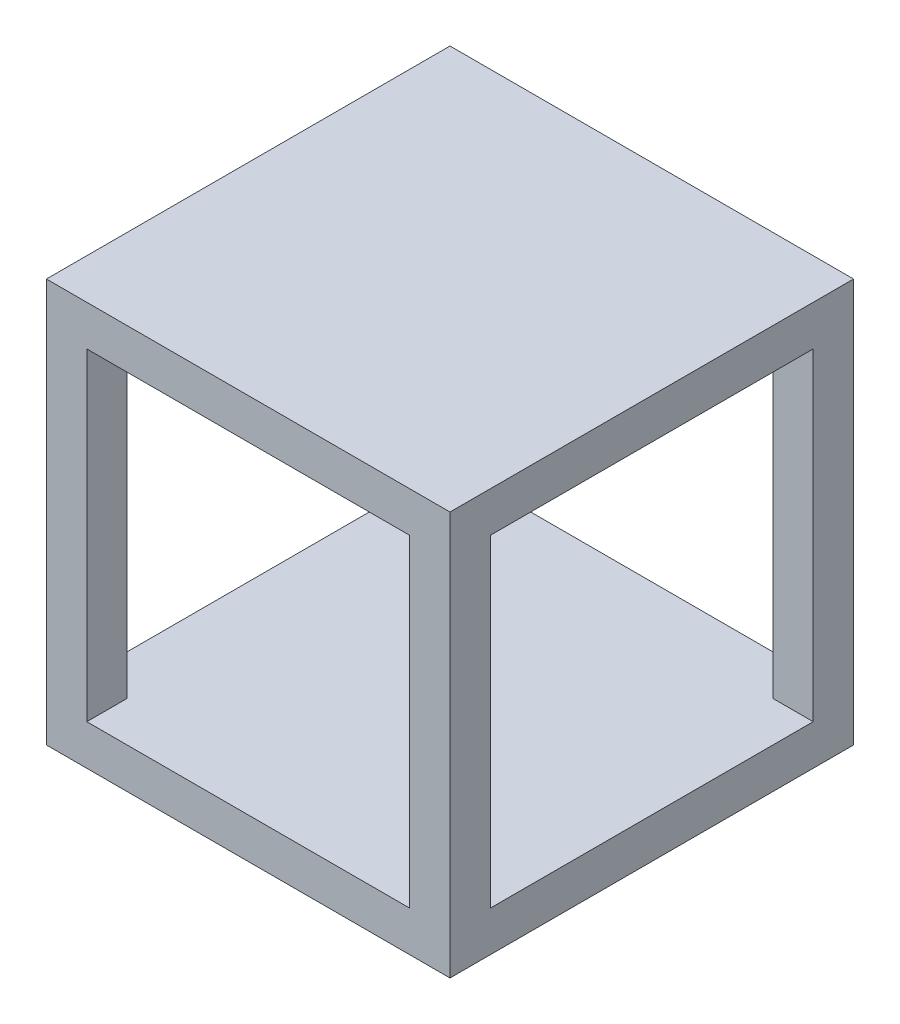
ISO-10303-21;
HEADER;
FILE_DESCRIPTION(('STEP AP214'),'2;1');
FILE_NAME('part.step','',(''),(''),'','','');
FILE_SCHEMA(('AUTOMOTIVE_DESIGN { 1 0 10303 214 1 1 1 1 }'));
ENDSEC;
DATA;
#1=APPLICATION_CONTEXT('core data for automotive mechanical design processes');
#2=APPLICATION_PROTOCOL_DEFINITION('international standard','automotive_design',2000,#1);
#3=PRODUCT_CONTEXT('',#1,'mechanical');
#4=PRODUCT('Part','Part','',(#3));
#5=PRODUCT_RELATED_PRODUCT_CATEGORY('part','',(#4));
#6=PRODUCT_DEFINITION_FORMATION('','',#4);
#7=PRODUCT_DEFINITION_CONTEXT('part definition',#1,'design');
#8=PRODUCT_DEFINITION('design','',#6,#7);
#9=PRODUCT_DEFINITION_SHAPE('','',#8);
#10=(LENGTH_UNIT() NAMED_UNIT(*) SI_UNIT(.MILLI.,.METRE.));
#11=(NAMED_UNIT(*) PLANE_ANGLE_UNIT() SI_UNIT($,.RADIAN.));
#12=(NAMED_UNIT(*) SI_UNIT($,.STERADIAN.) SOLID_ANGLE_UNIT());
#13=UNCERTAINTY_MEASURE_WITH_UNIT(LENGTH_MEASURE(1.E-05),#10,'distance_accuracy_value','');
#14=(GEOMETRIC_REPRESENTATION_CONTEXT(3) GLOBAL_UNCERTAINTY_ASSIGNED_CONTEXT((#13)) GLOBAL_UNIT_ASSIGNED_CONTEXT((#10,
#11,#12)) REPRESENTATION_CONTEXT('',''));
#15=CARTESIAN_POINT('',(0.,0.,0.));
#16=DIRECTION('',(0.,0.,1.));
#17=DIRECTION('',(1.,0.,0.));
#18=AXIS2_PLACEMENT_3D('',#15,#16,#17);
#19=CARTESIAN_POINT('',(0.,0.,50.));
#20=DIRECTION('',(0.,1.,0.));
#21=DIRECTION('',(0.,0.,1.));
#22=AXIS2_PLACEMENT_3D('',#19,#20,#21);
#23=PLANE('',#22);
#24=DIRECTION('',(1.,0.,0.));
#25=VECTOR('',#24,1.);
#26=CARTESIAN_POINT('',(0.,0.,0.));
#27=LINE('',#26,#25);
#28=CARTESIAN_POINT('',(0.,0.,0.));
#29=VERTEX_POINT('',#28);
#30=CARTESIAN_POINT('',(50.,0.,0.));
#31=VERTEX_POINT('',#30);
#32=EDGE_CURVE('E367',#29,#31,#27,.T.);
#33=ORIENTED_EDGE('',*,*,#32,.T.);
#34=DIRECTION('',(0.,0.,-1.));
#35=VECTOR('',#34,1.);
#36=CARTESIAN_POINT('',(50.,0.,50.));
#37=LINE('',#36,#35);
#38=CARTESIAN_POINT('',(50.,0.,50.));
#39=VERTEX_POINT('',#38);
#40=EDGE_CURVE('E371',#39,#31,#37,.T.);
#41=ORIENTED_EDGE('',*,*,#40,.F.);
#42=DIRECTION('',(1.,0.,0.));
#43=VECTOR('',#42,1.);
#44=CARTESIAN_POINT('',(0.,0.,50.));
#45=LINE('',#44,#43);
#46=CARTESIAN_POINT('',(0.,0.,50.));
#47=VERTEX_POINT('',#46);
#48=EDGE_CURVE('E357',#47,#39,#45,.T.);
#49=ORIENTED_EDGE('',*,*,#48,.F.);
#50=DIRECTION('',(0.,0.,-1.));
#51=VECTOR('',#50,1.);
#52=CARTESIAN_POINT('',(0.,0.,50.));
#53=LINE('',#52,#51);
#54=EDGE_CURVE('E42',#47,#29,#53,.T.);
#55=ORIENTED_EDGE('',*,*,#54,.T.);
#56=EDGE_LOOP('',(#33,#41,#49,#55));
#57=FACE_BOUND('',#56,.T.);
#58=DIRECTION('',(0.,0.,-1.));
#59=VECTOR('',#58,1.);
#60=CARTESIAN_POINT('',(47.75,0.,47.75));
#61=LINE('',#60,#59);
#62=CARTESIAN_POINT('',(47.75,0.,47.75));
#63=VERTEX_POINT('',#62);
#64=CARTESIAN_POINT('',(47.75,0.,2.25));
#65=VERTEX_POINT('',#64);
#66=EDGE_CURVE('E50',#63,#65,#61,.T.);
#67=ORIENTED_EDGE('',*,*,#66,.T.);
#68=DIRECTION('',(-1.,0.,0.));
#69=VECTOR('',#68,1.);
#70=CARTESIAN_POINT('',(47.75,0.,2.25));
#71=LINE('',#70,#69);
#72=CARTESIAN_POINT('',(2.25,0.,2.25));
#73=VERTEX_POINT('',#72);
#74=EDGE_CURVE('E249',#65,#73,#71,.T.);
#75=ORIENTED_EDGE('',*,*,#74,.T.);
#76=DIRECTION('',(0.,0.,1.));
#77=VECTOR('',#76,1.);
#78=CARTESIAN_POINT('',(2.25,0.,47.75));
#79=LINE('',#78,#77);
#80=CARTESIAN_POINT('',(2.25,0.,47.75));
#81=VERTEX_POINT('',#80);
#82=EDGE_CURVE('E252',#73,#81,#79,.T.);
#83=ORIENTED_EDGE('',*,*,#82,.T.);
#84=DIRECTION('',(1.,0.,0.));
#85=VECTOR('',#84,1.);
#86=CARTESIAN_POINT('',(47.75,0.,47.75));
#87=LINE('',#86,#85);
#88=EDGE_CURVE('E241',#81,#63,#87,.T.);
#89=ORIENTED_EDGE('',*,*,#88,.T.);
#90=EDGE_LOOP('',(#67,#75,#83,#89));
#91=FACE_BOUND('',#90,.T.);
#92=ADVANCED_FACE('F33',(#57,#91),#23,.F.);
#93=CARTESIAN_POINT('',(5.,45.,0.));
#94=DIRECTION('',(-1.,0.,0.));
#95=DIRECTION('',(0.,0.,1.));
#96=AXIS2_PLACEMENT_3D('',#93,#94,#95);
#97=PLANE('',#96);
#98=DIRECTION('',(0.,-1.,0.));
#99=VECTOR('',#98,1.);
#100=CARTESIAN_POINT('',(5.,45.,45.));
#101=LINE('',#100,#99);
#102=CARTESIAN_POINT('',(5.,45.,45.));
#103=VERTEX_POINT('',#102);
#104=CARTESIAN_POINT('',(5.,5.,45.));
#105=VERTEX_POINT('',#104);
#106=EDGE_CURVE('E301',#103,#105,#101,.T.);
#107=ORIENTED_EDGE('',*,*,#106,.F.);
#108=DIRECTION('',(0.,0.,1.));
#109=VECTOR('',#108,1.);
#110=CARTESIAN_POINT('',(5.,45.,0.));
#111=LINE('',#110,#109);
#112=CARTESIAN_POINT('',(5.,45.,50.));
#113=VERTEX_POINT('',#112);
#114=EDGE_CURVE('E339',#103,#113,#111,.T.);
#115=ORIENTED_EDGE('',*,*,#114,.T.);
#116=DIRECTION('',(0.,-1.,0.));
#117=VECTOR('',#116,1.);
#118=CARTESIAN_POINT('',(5.,45.,50.));
#119=LINE('',#118,#117);
#120=CARTESIAN_POINT('',(5.,5.,50.));
#121=VERTEX_POINT('',#120);
#122=EDGE_CURVE('E310',#113,#121,#119,.T.);
#123=ORIENTED_EDGE('',*,*,#122,.T.);
#124=DIRECTION('',(0.,0.,1.));
#125=VECTOR('',#124,1.);
#126=CARTESIAN_POINT('',(5.,5.,0.));
#127=LINE('',#126,#125);
#128=EDGE_CURVE('E324',#105,#121,#127,.T.);
#129=ORIENTED_EDGE('',*,*,#128,.F.);
#130=EDGE_LOOP('',(#107,#115,#123,#129));
#131=FACE_BOUND('',#130,.T.);
#132=ADVANCED_FACE('F395',(#131),#97,.F.);
#133=CARTESIAN_POINT('',(45.,45.,0.));
#134=DIRECTION('',(1.,0.,0.));
#135=DIRECTION('',(0.,1.,0.));
#136=AXIS2_PLACEMENT_3D('',#133,#134,#135);
#137=PLANE('',#136);
#138=DIRECTION('',(0.,1.,0.));
#139=VECTOR('',#138,1.);
#140=CARTESIAN_POINT('',(45.,45.,45.));
#141=LINE('',#140,#139);
#142=CARTESIAN_POINT('',(45.,5.,45.));
#143=VERTEX_POINT('',#142);
#144=CARTESIAN_POINT('',(45.,45.,45.));
#145=VERTEX_POINT('',#144);
#146=EDGE_CURVE('E299',#143,#145,#141,.T.);
#147=ORIENTED_EDGE('',*,*,#146,.F.);
#148=DIRECTION('',(0.,0.,1.));
#149=VECTOR('',#148,1.);
#150=CARTESIAN_POINT('',(45.,5.,0.));
#151=LINE('',#150,#149);
#152=CARTESIAN_POINT('',(45.,5.,50.));
#153=VERTEX_POINT('',#152);
#154=EDGE_CURVE('E347',#143,#153,#151,.T.);
#155=ORIENTED_EDGE('',*,*,#154,.T.);
#156=DIRECTION('',(0.,1.,0.));
#157=VECTOR('',#156,1.);
#158=CARTESIAN_POINT('',(45.,45.,50.));
#159=LINE('',#158,#157);
#160=CARTESIAN_POINT('',(45.,45.,50.));
#161=VERTEX_POINT('',#160);
#162=EDGE_CURVE('E330',#153,#161,#159,.T.);
#163=ORIENTED_EDGE('',*,*,#162,.T.);
#164=DIRECTION('',(0.,0.,1.));
#165=VECTOR('',#164,1.);
#166=CARTESIAN_POINT('',(45.,45.,0.));
#167=LINE('',#166,#165);
#168=EDGE_CURVE('E343',#145,#161,#167,.T.);
#169=ORIENTED_EDGE('',*,*,#168,.F.);
#170=EDGE_LOOP('',(#147,#155,#163,#169));
#171=FACE_BOUND('',#170,.T.);
#172=ADVANCED_FACE('F446',(#171),#137,.F.);
#173=CARTESIAN_POINT('',(0.,50.,50.));
#174=DIRECTION('',(0.,1.,0.));
#175=DIRECTION('',(0.,0.,1.));
#176=AXIS2_PLACEMENT_3D('',#173,#174,#175);
#177=PLANE('',#176);
#178=DIRECTION('',(1.,0.,0.));
#179=VECTOR('',#178,1.);
#180=CARTESIAN_POINT('',(0.,50.,0.));
#181=LINE('',#180,#179);
#182=CARTESIAN_POINT('',(0.,50.,0.));
#183=VERTEX_POINT('',#182);
#184=CARTESIAN_POINT('',(50.,50.,0.));
#185=VERTEX_POINT('',#184);
#186=EDGE_CURVE('E338',#183,#185,#181,.T.);
#187=ORIENTED_EDGE('',*,*,#186,.F.);
#188=DIRECTION('',(0.,0.,-1.));
#189=VECTOR('',#188,1.);
#190=CARTESIAN_POINT('',(0.,50.,50.));
#191=LINE('',#190,#189);
#192=CARTESIAN_POINT('',(0.,50.,50.));
#193=VERTEX_POINT('',#192);
#194=EDGE_CURVE('E11',#193,#183,#191,.T.);
#195=ORIENTED_EDGE('',*,*,#194,.F.);
#196=DIRECTION('',(1.,0.,0.));
#197=VECTOR('',#196,1.);
#198=CARTESIAN_POINT('',(0.,50.,50.));
#199=LINE('',#198,#197);
#200=CARTESIAN_POINT('',(50.,50.,50.));
#201=VERTEX_POINT('',#200);
#202=EDGE_CURVE('E351',#193,#201,#199,.T.);
#203=ORIENTED_EDGE('',*,*,#202,.T.);
#204=DIRECTION('',(0.,0.,-1.));
#205=VECTOR('',#204,1.);
#206=CARTESIAN_POINT('',(50.,50.,50.));
#207=LINE('',#206,#205);
#208=EDGE_CURVE('E37',#201,#185,#207,.T.);
#209=ORIENTED_EDGE('',*,*,#208,.T.);
#210=EDGE_LOOP('',(#187,#195,#203,#209));
#211=FACE_BOUND('',#210,.T.);
#212=ADVANCED_FACE('F35',(#211),#177,.T.);
#213=CARTESIAN_POINT('',(0.,0.,50.));
#214=DIRECTION('',(-1.,0.,0.));
#215=DIRECTION('',(0.,0.,1.));
#216=AXIS2_PLACEMENT_3D('',#213,#214,#215);
#217=PLANE('',#216);
#218=DIRECTION('',(0.,-1.,0.));
#219=VECTOR('',#218,1.);
#220=CARTESIAN_POINT('',(0.,0.,5.));
#221=LINE('',#220,#219);
#222=CARTESIAN_POINT('',(0.,45.,5.));
#223=VERTEX_POINT('',#222);
#224=CARTESIAN_POINT('',(0.,5.,5.));
#225=VERTEX_POINT('',#224);
#226=EDGE_CURVE('E264',#223,#225,#221,.T.);
#227=ORIENTED_EDGE('',*,*,#226,.F.);
#228=DIRECTION('',(0.,0.,-1.));
#229=VECTOR('',#228,1.);
#230=CARTESIAN_POINT('',(0.,45.,0.));
#231=LINE('',#230,#229);
#232=CARTESIAN_POINT('',(0.,45.,45.));
#233=VERTEX_POINT('',#232);
#234=EDGE_CURVE('E279',#233,#223,#231,.T.);
#235=ORIENTED_EDGE('',*,*,#234,.F.);
#236=DIRECTION('',(0.,-1.,0.));
#237=VECTOR('',#236,1.);
#238=CARTESIAN_POINT('',(0.,0.,45.));
#239=LINE('',#238,#237);
#240=CARTESIAN_POINT('',(0.,5.,45.));
#241=VERTEX_POINT('',#240);
#242=EDGE_CURVE('E282',#233,#241,#239,.T.);
#243=ORIENTED_EDGE('',*,*,#242,.T.);
#244=DIRECTION('',(0.,0.,-1.));
#245=VECTOR('',#244,1.);
#246=CARTESIAN_POINT('',(0.,5.,0.));
#247=LINE('',#246,#245);
#248=EDGE_CURVE('E269',#241,#225,#247,.T.);
#249=ORIENTED_EDGE('',*,*,#248,.T.);
#250=EDGE_LOOP('',(#227,#235,#243,#249));
#251=FACE_BOUND('',#250,.T.);
#252=DIRECTION('',(0.,1.,0.));
#253=VECTOR('',#252,1.);
#254=CARTESIAN_POINT('',(0.,0.,0.));
#255=LINE('',#254,#253);
#256=EDGE_CURVE('E355',#29,#183,#255,.T.);
#257=ORIENTED_EDGE('',*,*,#256,.F.);
#258=ORIENTED_EDGE('',*,*,#54,.F.);
#259=DIRECTION('',(0.,1.,0.));
#260=VECTOR('',#259,1.);
#261=CARTESIAN_POINT('',(0.,0.,50.));
#262=LINE('',#261,#260);
#263=EDGE_CURVE('E359',#47,#193,#262,.T.);
#264=ORIENTED_EDGE('',*,*,#263,.T.);
#265=ORIENTED_EDGE('',*,*,#194,.T.);
#266=EDGE_LOOP('',(#257,#258,#264,#265));
#267=FACE_BOUND('',#266,.T.);
#268=ADVANCED_FACE('F387',(#251,#267),#217,.T.);
#269=CARTESIAN_POINT('',(50.,0.,50.));
#270=DIRECTION('',(-1.,0.,0.));
#271=DIRECTION('',(0.,0.,1.));
#272=AXIS2_PLACEMENT_3D('',#269,#270,#271);
#273=PLANE('',#272);
#274=DIRECTION('',(0.,0.,-1.));
#275=VECTOR('',#274,1.);
#276=CARTESIAN_POINT('',(50.,45.,0.));
#277=LINE('',#276,#275);
#278=CARTESIAN_POINT('',(50.,45.,45.));
#279=VERTEX_POINT('',#278);
#280=CARTESIAN_POINT('',(50.,45.,5.));
#281=VERTEX_POINT('',#280);
#282=EDGE_CURVE('E268',#279,#281,#277,.T.);
#283=ORIENTED_EDGE('',*,*,#282,.T.);
#284=DIRECTION('',(0.,-1.,0.));
#285=VECTOR('',#284,1.);
#286=CARTESIAN_POINT('',(50.,0.,5.));
#287=LINE('',#286,#285);
#288=CARTESIAN_POINT('',(50.,5.,5.));
#289=VERTEX_POINT('',#288);
#290=EDGE_CURVE('E265',#281,#289,#287,.T.);
#291=ORIENTED_EDGE('',*,*,#290,.T.);
#292=DIRECTION('',(0.,0.,-1.));
#293=VECTOR('',#292,1.);
#294=CARTESIAN_POINT('',(50.,5.,0.));
#295=LINE('',#294,#293);
#296=CARTESIAN_POINT('',(50.,5.,45.));
#297=VERTEX_POINT('',#296);
#298=EDGE_CURVE('E275',#297,#289,#295,.T.);
#299=ORIENTED_EDGE('',*,*,#298,.F.);
#300=DIRECTION('',(0.,-1.,0.));
#301=VECTOR('',#300,1.);
#302=CARTESIAN_POINT('',(50.,0.,45.));
#303=LINE('',#302,#301);
#304=EDGE_CURVE('E272',#279,#297,#303,.T.);
#305=ORIENTED_EDGE('',*,*,#304,.F.);
#306=EDGE_LOOP('',(#283,#291,#299,#305));
#307=FACE_BOUND('',#306,.T.);
#308=DIRECTION('',(0.,1.,0.));
#309=VECTOR('',#308,1.);
#310=CARTESIAN_POINT('',(50.,0.,0.));
#311=LINE('',#310,#309);
#312=EDGE_CURVE('E364',#31,#185,#311,.T.);
#313=ORIENTED_EDGE('',*,*,#312,.T.);
#314=ORIENTED_EDGE('',*,*,#208,.F.);
#315=DIRECTION('',(0.,1.,0.));
#316=VECTOR('',#315,1.);
#317=CARTESIAN_POINT('',(50.,0.,50.));
#318=LINE('',#317,#316);
#319=EDGE_CURVE('E354',#39,#201,#318,.T.);
#320=ORIENTED_EDGE('',*,*,#319,.F.);
#321=ORIENTED_EDGE('',*,*,#40,.T.);
#322=EDGE_LOOP('',(#313,#314,#320,#321));
#323=FACE_BOUND('',#322,.T.);
#324=ADVANCED_FACE('F381',(#307,#323),#273,.F.);
#325=CARTESIAN_POINT('',(0.,0.,50.));
#326=DIRECTION('',(0.,0.,1.));
#327=DIRECTION('',(1.,0.,0.));
#328=AXIS2_PLACEMENT_3D('',#325,#326,#327);
#329=PLANE('',#328);
#330=ORIENTED_EDGE('',*,*,#122,.F.);
#331=DIRECTION('',(-1.,0.,0.));
#332=VECTOR('',#331,1.);
#333=CARTESIAN_POINT('',(5.,45.,50.));
#334=LINE('',#333,#332);
#335=EDGE_CURVE('E315',#161,#113,#334,.T.);
#336=ORIENTED_EDGE('',*,*,#335,.F.);
#337=ORIENTED_EDGE('',*,*,#162,.F.);
#338=DIRECTION('',(1.,0.,0.));
#339=VECTOR('',#338,1.);
#340=CARTESIAN_POINT('',(5.,5.,50.));
#341=LINE('',#340,#339);
#342=EDGE_CURVE('E327',#121,#153,#341,.T.);
#343=ORIENTED_EDGE('',*,*,#342,.F.);
#344=EDGE_LOOP('',(#330,#336,#337,#343));
#345=FACE_BOUND('',#344,.T.);
#346=ORIENTED_EDGE('',*,*,#202,.F.);
#347=ORIENTED_EDGE('',*,*,#263,.F.);
#348=ORIENTED_EDGE('',*,*,#48,.T.);
#349=ORIENTED_EDGE('',*,*,#319,.T.);
#350=EDGE_LOOP('',(#346,#347,#348,#349));
#351=FACE_BOUND('',#350,.T.);
#352=ADVANCED_FACE('F391',(#345,#351),#329,.T.);
#353=CARTESIAN_POINT('',(0.,0.,0.));
#354=DIRECTION('',(0.,0.,1.));
#355=DIRECTION('',(1.,0.,0.));
#356=AXIS2_PLACEMENT_3D('',#353,#354,#355);
#357=PLANE('',#356);
#358=DIRECTION('',(-1.,0.,0.));
#359=VECTOR('',#358,1.);
#360=CARTESIAN_POINT('',(5.,45.,0.));
#361=LINE('',#360,#359);
#362=CARTESIAN_POINT('',(45.,45.,0.));
#363=VERTEX_POINT('',#362);
#364=CARTESIAN_POINT('',(5.,45.,0.));
#365=VERTEX_POINT('',#364);
#366=EDGE_CURVE('E321',#363,#365,#361,.T.);
#367=ORIENTED_EDGE('',*,*,#366,.T.);
#368=DIRECTION('',(0.,-1.,0.));
#369=VECTOR('',#368,1.);
#370=CARTESIAN_POINT('',(5.,45.,0.));
#371=LINE('',#370,#369);
#372=CARTESIAN_POINT('',(5.,5.,0.));
#373=VERTEX_POINT('',#372);
#374=EDGE_CURVE('E311',#365,#373,#371,.T.);
#375=ORIENTED_EDGE('',*,*,#374,.T.);
#376=DIRECTION('',(1.,0.,0.));
#377=VECTOR('',#376,1.);
#378=CARTESIAN_POINT('',(5.,5.,0.));
#379=LINE('',#378,#377);
#380=CARTESIAN_POINT('',(45.,5.,0.));
#381=VERTEX_POINT('',#380);
#382=EDGE_CURVE('E314',#373,#381,#379,.T.);
#383=ORIENTED_EDGE('',*,*,#382,.T.);
#384=DIRECTION('',(0.,1.,0.));
#385=VECTOR('',#384,1.);
#386=CARTESIAN_POINT('',(45.,45.,0.));
#387=LINE('',#386,#385);
#388=EDGE_CURVE('E318',#381,#363,#387,.T.);
#389=ORIENTED_EDGE('',*,*,#388,.T.);
#390=EDGE_LOOP('',(#367,#375,#383,#389));
#391=FACE_BOUND('',#390,.T.);
#392=ORIENTED_EDGE('',*,*,#186,.T.);
#393=ORIENTED_EDGE('',*,*,#312,.F.);
#394=ORIENTED_EDGE('',*,*,#32,.F.);
#395=ORIENTED_EDGE('',*,*,#256,.T.);
#396=EDGE_LOOP('',(#392,#393,#394,#395));
#397=FACE_BOUND('',#396,.T.);
#398=ADVANCED_FACE('F384',(#391,#397),#357,.F.);
#399=CARTESIAN_POINT('',(5.,45.,5.));
#400=VERTEX_POINT('',#399);
#401=EDGE_CURVE('E335',#365,#400,#111,.T.);
#402=ORIENTED_EDGE('',*,*,#401,.T.);
#403=DIRECTION('',(0.,-1.,0.));
#404=VECTOR('',#403,1.);
#405=CARTESIAN_POINT('',(5.,45.,5.));
#406=LINE('',#405,#404);
#407=CARTESIAN_POINT('',(5.,5.,5.));
#408=VERTEX_POINT('',#407);
#409=EDGE_CURVE('E307',#400,#408,#406,.T.);
#410=ORIENTED_EDGE('',*,*,#409,.T.);
#411=EDGE_CURVE('E348',#373,#408,#127,.T.);
#412=ORIENTED_EDGE('',*,*,#411,.F.);
#413=ORIENTED_EDGE('',*,*,#374,.F.);
#414=EDGE_LOOP('',(#402,#410,#412,#413));
#415=FACE_BOUND('',#414,.T.);
#416=ADVANCED_FACE('F440',(#415),#97,.F.);
#417=CARTESIAN_POINT('',(5.,45.,0.));
#418=DIRECTION('',(0.,1.,0.));
#419=DIRECTION('',(0.,0.,1.));
#420=AXIS2_PLACEMENT_3D('',#417,#418,#419);
#421=PLANE('',#420);
#422=CARTESIAN_POINT('',(45.,45.,5.));
#423=VERTEX_POINT('',#422);
#424=EDGE_CURVE('E340',#363,#423,#167,.T.);
#425=ORIENTED_EDGE('',*,*,#424,.T.);
#426=DIRECTION('',(-1.,0.,0.));
#427=VECTOR('',#426,1.);
#428=CARTESIAN_POINT('',(50.,45.,5.));
#429=LINE('',#428,#427);
#430=EDGE_CURVE('E297',#281,#423,#429,.T.);
#431=ORIENTED_EDGE('',*,*,#430,.F.);
#432=ORIENTED_EDGE('',*,*,#282,.F.);
#433=DIRECTION('',(-1.,0.,0.));
#434=VECTOR('',#433,1.);
#435=CARTESIAN_POINT('',(50.,45.,45.));
#436=LINE('',#435,#434);
#437=EDGE_CURVE('E293',#279,#145,#436,.T.);
#438=ORIENTED_EDGE('',*,*,#437,.T.);
#439=ORIENTED_EDGE('',*,*,#168,.T.);
#440=ORIENTED_EDGE('',*,*,#335,.T.);
#441=ORIENTED_EDGE('',*,*,#114,.F.);
#442=EDGE_CURVE('E292',#103,#233,#436,.T.);
#443=ORIENTED_EDGE('',*,*,#442,.T.);
#444=ORIENTED_EDGE('',*,*,#234,.T.);
#445=EDGE_CURVE('E296',#400,#223,#429,.T.);
#446=ORIENTED_EDGE('',*,*,#445,.F.);
#447=ORIENTED_EDGE('',*,*,#401,.F.);
#448=ORIENTED_EDGE('',*,*,#366,.F.);
#449=EDGE_LOOP('',(#425,#431,#432,#438,#439,#440,#441,#443,#444,#446,#447,#448));
#450=FACE_BOUND('',#449,.T.);
#451=ADVANCED_FACE('F436',(#450),#421,.F.);
#452=CARTESIAN_POINT('',(45.,5.,5.));
#453=VERTEX_POINT('',#452);
#454=EDGE_CURVE('E344',#381,#453,#151,.T.);
#455=ORIENTED_EDGE('',*,*,#454,.T.);
#456=DIRECTION('',(0.,1.,0.));
#457=VECTOR('',#456,1.);
#458=CARTESIAN_POINT('',(45.,45.,5.));
#459=LINE('',#458,#457);
#460=EDGE_CURVE('E304',#453,#423,#459,.T.);
#461=ORIENTED_EDGE('',*,*,#460,.T.);
#462=ORIENTED_EDGE('',*,*,#424,.F.);
#463=ORIENTED_EDGE('',*,*,#388,.F.);
#464=EDGE_LOOP('',(#455,#461,#462,#463));
#465=FACE_BOUND('',#464,.T.);
#466=ADVANCED_FACE('F439',(#465),#137,.F.);
#467=CARTESIAN_POINT('',(5.,5.,0.));
#468=DIRECTION('',(0.,-1.,0.));
#469=DIRECTION('',(1.,0.,0.));
#470=AXIS2_PLACEMENT_3D('',#467,#468,#469);
#471=PLANE('',#470);
#472=ORIENTED_EDGE('',*,*,#411,.T.);
#473=DIRECTION('',(-1.,0.,0.));
#474=VECTOR('',#473,1.);
#475=CARTESIAN_POINT('',(50.,5.,5.));
#476=LINE('',#475,#474);
#477=EDGE_CURVE('E277',#408,#225,#476,.T.);
#478=ORIENTED_EDGE('',*,*,#477,.T.);
#479=ORIENTED_EDGE('',*,*,#248,.F.);
#480=DIRECTION('',(-1.,0.,0.));
#481=VECTOR('',#480,1.);
#482=CARTESIAN_POINT('',(50.,5.,45.));
#483=LINE('',#482,#481);
#484=EDGE_CURVE('E289',#105,#241,#483,.T.);
#485=ORIENTED_EDGE('',*,*,#484,.F.);
#486=ORIENTED_EDGE('',*,*,#128,.T.);
#487=ORIENTED_EDGE('',*,*,#342,.T.);
#488=ORIENTED_EDGE('',*,*,#154,.F.);
#489=EDGE_CURVE('E290',#297,#143,#483,.T.);
#490=ORIENTED_EDGE('',*,*,#489,.F.);
#491=ORIENTED_EDGE('',*,*,#298,.T.);
#492=EDGE_CURVE('E287',#289,#453,#476,.T.);
#493=ORIENTED_EDGE('',*,*,#492,.T.);
#494=ORIENTED_EDGE('',*,*,#454,.F.);
#495=ORIENTED_EDGE('',*,*,#382,.F.);
#496=EDGE_LOOP('',(#472,#478,#479,#485,#486,#487,#488,#490,#491,#493,#494,#495));
#497=FACE_BOUND('',#496,.T.);
#498=ADVANCED_FACE('F444',(#497),#471,.F.);
#499=CARTESIAN_POINT('',(50.,0.,45.));
#500=DIRECTION('',(0.,0.,-1.));
#501=DIRECTION('',(0.,1.,0.));
#502=AXIS2_PLACEMENT_3D('',#499,#500,#501);
#503=PLANE('',#502);
#504=ORIENTED_EDGE('',*,*,#146,.T.);
#505=ORIENTED_EDGE('',*,*,#437,.F.);
#506=ORIENTED_EDGE('',*,*,#304,.T.);
#507=ORIENTED_EDGE('',*,*,#489,.T.);
#508=EDGE_LOOP('',(#504,#505,#506,#507));
#509=FACE_BOUND('',#508,.T.);
#510=ADVANCED_FACE('F431',(#509),#503,.T.);
#511=CARTESIAN_POINT('',(50.,0.,5.));
#512=DIRECTION('',(0.,0.,-1.));
#513=DIRECTION('',(0.,1.,0.));
#514=AXIS2_PLACEMENT_3D('',#511,#512,#513);
#515=PLANE('',#514);
#516=ORIENTED_EDGE('',*,*,#492,.F.);
#517=ORIENTED_EDGE('',*,*,#290,.F.);
#518=ORIENTED_EDGE('',*,*,#430,.T.);
#519=ORIENTED_EDGE('',*,*,#460,.F.);
#520=EDGE_LOOP('',(#516,#517,#518,#519));
#521=FACE_BOUND('',#520,.T.);
#522=ADVANCED_FACE('F434',(#521),#515,.F.);
#523=ORIENTED_EDGE('',*,*,#445,.T.);
#524=ORIENTED_EDGE('',*,*,#226,.T.);
#525=ORIENTED_EDGE('',*,*,#477,.F.);
#526=ORIENTED_EDGE('',*,*,#409,.F.);
#527=EDGE_LOOP('',(#523,#524,#525,#526));
#528=FACE_BOUND('',#527,.T.);
#529=ADVANCED_FACE('F429',(#528),#515,.F.);
#530=ORIENTED_EDGE('',*,*,#106,.T.);
#531=ORIENTED_EDGE('',*,*,#484,.T.);
#532=ORIENTED_EDGE('',*,*,#242,.F.);
#533=ORIENTED_EDGE('',*,*,#442,.F.);
#534=EDGE_LOOP('',(#530,#531,#532,#533));
#535=FACE_BOUND('',#534,.T.);
#536=ADVANCED_FACE('F426',(#535),#503,.T.);
#537=CARTESIAN_POINT('',(0.,2.5,0.));
#538=DIRECTION('',(0.,1.,0.));
#539=DIRECTION('',(0.,0.,1.));
#540=AXIS2_PLACEMENT_3D('',#537,#538,#539);
#541=PLANE('',#540);
#542=DIRECTION('',(0.,0.,-1.));
#543=VECTOR('',#542,1.);
#544=CARTESIAN_POINT('',(47.75,2.5,47.75));
#545=LINE('',#544,#543);
#546=CARTESIAN_POINT('',(47.75,2.5,47.75));
#547=VERTEX_POINT('',#546);
#548=CARTESIAN_POINT('',(47.75,2.5,2.25));
#549=VERTEX_POINT('',#548);
#550=EDGE_CURVE('E237',#547,#549,#545,.T.);
#551=ORIENTED_EDGE('',*,*,#550,.F.);
#552=DIRECTION('',(1.,0.,0.));
#553=VECTOR('',#552,1.);
#554=CARTESIAN_POINT('',(47.75,2.5,47.75));
#555=LINE('',#554,#553);
#556=CARTESIAN_POINT('',(2.25,2.5,47.75));
#557=VERTEX_POINT('',#556);
#558=EDGE_CURVE('E245',#557,#547,#555,.T.);
#559=ORIENTED_EDGE('',*,*,#558,.F.);
#560=DIRECTION('',(0.,0.,1.));
#561=VECTOR('',#560,1.);
#562=CARTESIAN_POINT('',(2.25,2.5,47.75));
#563=LINE('',#562,#561);
#564=CARTESIAN_POINT('',(2.25,2.5,2.25));
#565=VERTEX_POINT('',#564);
#566=EDGE_CURVE('E243',#565,#557,#563,.T.);
#567=ORIENTED_EDGE('',*,*,#566,.F.);
#568=DIRECTION('',(-1.,0.,0.));
#569=VECTOR('',#568,1.);
#570=CARTESIAN_POINT('',(47.75,2.5,2.25));
#571=LINE('',#570,#569);
#572=EDGE_CURVE('E240',#549,#565,#571,.T.);
#573=ORIENTED_EDGE('',*,*,#572,.F.);
#574=EDGE_LOOP('',(#551,#559,#567,#573));
#575=FACE_BOUND('',#574,.T.);
#576=DIRECTION('',(1.,0.,0.));
#577=VECTOR('',#576,1.);
#578=CARTESIAN_POINT('',(4.5,2.5,45.4097753631132));
#579=LINE('',#578,#577);
#580=CARTESIAN_POINT('',(4.5,2.5,45.4097753631132));
#581=VERTEX_POINT('',#580);
#582=CARTESIAN_POINT('',(45.5635213168841,2.5,45.4097753631132));
#583=VERTEX_POINT('',#582);
#584=EDGE_CURVE('E201',#581,#583,#579,.T.);
#585=ORIENTED_EDGE('',*,*,#584,.T.);
#586=DIRECTION('',(0.,0.,-1.));
#587=VECTOR('',#586,1.);
#588=CARTESIAN_POINT('',(45.5635213168841,2.5,4.5));
#589=LINE('',#588,#587);
#590=CARTESIAN_POINT('',(45.5635213168841,2.5,4.5));
#591=VERTEX_POINT('',#590);
#592=EDGE_CURVE('E221',#583,#591,#589,.T.);
#593=ORIENTED_EDGE('',*,*,#592,.T.);
#594=DIRECTION('',(-1.,0.,0.));
#595=VECTOR('',#594,1.);
#596=CARTESIAN_POINT('',(4.5,2.5,4.5));
#597=LINE('',#596,#595);
#598=CARTESIAN_POINT('',(4.5,2.5,4.5));
#599=VERTEX_POINT('',#598);
#600=EDGE_CURVE('E204',#591,#599,#597,.T.);
#601=ORIENTED_EDGE('',*,*,#600,.T.);
#602=DIRECTION('',(0.,0.,1.));
#603=VECTOR('',#602,1.);
#604=CARTESIAN_POINT('',(4.5,2.5,4.5));
#605=LINE('',#604,#603);
#606=EDGE_CURVE('E196',#599,#581,#605,.T.);
#607=ORIENTED_EDGE('',*,*,#606,.T.);
#608=EDGE_LOOP('',(#585,#593,#601,#607));
#609=FACE_BOUND('',#608,.T.);
#610=ADVANCED_FACE('F198',(#575,#609),#541,.F.);
#611=CARTESIAN_POINT('',(47.75,2.5,47.75));
#612=DIRECTION('',(-1.,0.,0.));
#613=DIRECTION('',(0.,0.,1.));
#614=AXIS2_PLACEMENT_3D('',#611,#612,#613);
#615=PLANE('',#614);
#616=ORIENTED_EDGE('',*,*,#66,.F.);
#617=DIRECTION('',(0.,-1.,0.));
#618=VECTOR('',#617,1.);
#619=CARTESIAN_POINT('',(47.75,2.5,47.75));
#620=LINE('',#619,#618);
#621=EDGE_CURVE('E247',#547,#63,#620,.T.);
#622=ORIENTED_EDGE('',*,*,#621,.F.);
#623=ORIENTED_EDGE('',*,*,#550,.T.);
#624=DIRECTION('',(0.,-1.,0.));
#625=VECTOR('',#624,1.);
#626=CARTESIAN_POINT('',(47.75,2.5,2.25));
#627=LINE('',#626,#625);
#628=EDGE_CURVE('E262',#549,#65,#627,.T.);
#629=ORIENTED_EDGE('',*,*,#628,.T.);
#630=EDGE_LOOP('',(#616,#622,#623,#629));
#631=FACE_BOUND('',#630,.T.);
#632=ADVANCED_FACE('F405',(#631),#615,.T.);
#633=CARTESIAN_POINT('',(47.75,2.5,2.25));
#634=DIRECTION('',(0.,0.,1.));
#635=DIRECTION('',(1.,0.,0.));
#636=AXIS2_PLACEMENT_3D('',#633,#634,#635);
#637=PLANE('',#636);
#638=ORIENTED_EDGE('',*,*,#74,.F.);
#639=ORIENTED_EDGE('',*,*,#628,.F.);
#640=ORIENTED_EDGE('',*,*,#572,.T.);
#641=DIRECTION('',(0.,-1.,0.));
#642=VECTOR('',#641,1.);
#643=CARTESIAN_POINT('',(2.25,2.5,2.25));
#644=LINE('',#643,#642);
#645=EDGE_CURVE('E260',#565,#73,#644,.T.);
#646=ORIENTED_EDGE('',*,*,#645,.T.);
#647=EDGE_LOOP('',(#638,#639,#640,#646));
#648=FACE_BOUND('',#647,.T.);
#649=ADVANCED_FACE('F411',(#648),#637,.T.);
#650=CARTESIAN_POINT('',(2.25,2.5,47.75));
#651=DIRECTION('',(1.,0.,0.));
#652=DIRECTION('',(0.,0.,-1.));
#653=AXIS2_PLACEMENT_3D('',#650,#651,#652);
#654=PLANE('',#653);
#655=ORIENTED_EDGE('',*,*,#82,.F.);
#656=ORIENTED_EDGE('',*,*,#645,.F.);
#657=ORIENTED_EDGE('',*,*,#566,.T.);
#658=DIRECTION('',(0.,-1.,0.));
#659=VECTOR('',#658,1.);
#660=CARTESIAN_POINT('',(2.25,2.5,47.75));
#661=LINE('',#660,#659);
#662=EDGE_CURVE('E258',#557,#81,#661,.T.);
#663=ORIENTED_EDGE('',*,*,#662,.T.);
#664=EDGE_LOOP('',(#655,#656,#657,#663));
#665=FACE_BOUND('',#664,.T.);
#666=ADVANCED_FACE('F413',(#665),#654,.T.);
#667=CARTESIAN_POINT('',(47.75,2.5,47.75));
#668=DIRECTION('',(0.,0.,-1.));
#669=DIRECTION('',(-1.,0.,0.));
#670=AXIS2_PLACEMENT_3D('',#667,#668,#669);
#671=PLANE('',#670);
#672=ORIENTED_EDGE('',*,*,#88,.F.);
#673=ORIENTED_EDGE('',*,*,#662,.F.);
#674=ORIENTED_EDGE('',*,*,#558,.T.);
#675=ORIENTED_EDGE('',*,*,#621,.T.);
#676=EDGE_LOOP('',(#672,#673,#674,#675));
#677=FACE_BOUND('',#676,.T.);
#678=ADVANCED_FACE('F402',(#677),#671,.T.);
#679=CARTESIAN_POINT('',(4.5,2.5,4.5));
#680=DIRECTION('',(1.,0.,0.));
#681=DIRECTION('',(0.,0.,-1.));
#682=AXIS2_PLACEMENT_3D('',#679,#680,#681);
#683=PLANE('',#682);
#684=DIRECTION('',(0.,0.,1.));
#685=VECTOR('',#684,1.);
#686=CARTESIAN_POINT('',(4.5,0.,4.5));
#687=LINE('',#686,#685);
#688=CARTESIAN_POINT('',(4.5,0.,4.5));
#689=VERTEX_POINT('',#688);
#690=CARTESIAN_POINT('',(4.5,0.,45.4097753631132));
#691=VERTEX_POINT('',#690);
#692=EDGE_CURVE('E213',#689,#691,#687,.T.);
#693=ORIENTED_EDGE('',*,*,#692,.T.);
#694=DIRECTION('',(0.,-1.,0.));
#695=VECTOR('',#694,1.);
#696=CARTESIAN_POINT('',(4.5,2.5,45.4097753631132));
#697=LINE('',#696,#695);
#698=EDGE_CURVE('E210',#581,#691,#697,.T.);
#699=ORIENTED_EDGE('',*,*,#698,.F.);
#700=ORIENTED_EDGE('',*,*,#606,.F.);
#701=DIRECTION('',(0.,-1.,0.));
#702=VECTOR('',#701,1.);
#703=CARTESIAN_POINT('',(4.5,2.5,4.5));
#704=LINE('',#703,#702);
#705=EDGE_CURVE('E226',#599,#689,#704,.T.);
#706=ORIENTED_EDGE('',*,*,#705,.T.);
#707=EDGE_LOOP('',(#693,#699,#700,#706));
#708=FACE_BOUND('',#707,.T.);
#709=ADVANCED_FACE('F211',(#708),#683,.F.);
#710=CARTESIAN_POINT('',(4.5,2.5,45.4097753631132));
#711=DIRECTION('',(0.,0.,-1.));
#712=DIRECTION('',(-1.,0.,0.));
#713=AXIS2_PLACEMENT_3D('',#710,#711,#712);
#714=PLANE('',#713);
#715=DIRECTION('',(1.,0.,0.));
#716=VECTOR('',#715,1.);
#717=CARTESIAN_POINT('',(4.5,0.,45.4097753631132));
#718=LINE('',#717,#716);
#719=CARTESIAN_POINT('',(45.5635213168841,0.,45.4097753631132));
#720=VERTEX_POINT('',#719);
#721=EDGE_CURVE('E228',#691,#720,#718,.T.);
#722=ORIENTED_EDGE('',*,*,#721,.T.);
#723=DIRECTION('',(0.,-1.,0.));
#724=VECTOR('',#723,1.);
#725=CARTESIAN_POINT('',(45.5635213168841,2.5,45.4097753631132));
#726=LINE('',#725,#724);
#727=EDGE_CURVE('E217',#583,#720,#726,.T.);
#728=ORIENTED_EDGE('',*,*,#727,.F.);
#729=ORIENTED_EDGE('',*,*,#584,.F.);
#730=ORIENTED_EDGE('',*,*,#698,.T.);
#731=EDGE_LOOP('',(#722,#728,#729,#730));
#732=FACE_BOUND('',#731,.T.);
#733=ADVANCED_FACE('F219',(#732),#714,.F.);
#734=CARTESIAN_POINT('',(45.5635213168841,2.5,4.5));
#735=DIRECTION('',(-1.,0.,0.));
#736=DIRECTION('',(0.,0.,1.));
#737=AXIS2_PLACEMENT_3D('',#734,#735,#736);
#738=PLANE('',#737);
#739=DIRECTION('',(0.,0.,-1.));
#740=VECTOR('',#739,1.);
#741=CARTESIAN_POINT('',(45.5635213168841,0.,4.5));
#742=LINE('',#741,#740);
#743=CARTESIAN_POINT('',(45.5635213168841,0.,4.5));
#744=VERTEX_POINT('',#743);
#745=EDGE_CURVE('E58',#720,#744,#742,.T.);
#746=ORIENTED_EDGE('',*,*,#745,.T.);
#747=DIRECTION('',(0.,-1.,0.));
#748=VECTOR('',#747,1.);
#749=CARTESIAN_POINT('',(45.5635213168841,2.5,4.5));
#750=LINE('',#749,#748);
#751=EDGE_CURVE('E234',#591,#744,#750,.T.);
#752=ORIENTED_EDGE('',*,*,#751,.F.);
#753=ORIENTED_EDGE('',*,*,#592,.F.);
#754=ORIENTED_EDGE('',*,*,#727,.T.);
#755=EDGE_LOOP('',(#746,#752,#753,#754));
#756=FACE_BOUND('',#755,.T.);
#757=ADVANCED_FACE('F626',(#756),#738,.F.);
#758=CARTESIAN_POINT('',(4.5,2.5,4.5));
#759=DIRECTION('',(0.,0.,1.));
#760=DIRECTION('',(1.,0.,0.));
#761=AXIS2_PLACEMENT_3D('',#758,#759,#760);
#762=PLANE('',#761);
#763=DIRECTION('',(-1.,0.,0.));
#764=VECTOR('',#763,1.);
#765=CARTESIAN_POINT('',(4.5,0.,4.5));
#766=LINE('',#765,#764);
#767=EDGE_CURVE('E207',#744,#689,#766,.T.);
#768=ORIENTED_EDGE('',*,*,#767,.T.);
#769=ORIENTED_EDGE('',*,*,#705,.F.);
#770=ORIENTED_EDGE('',*,*,#600,.F.);
#771=ORIENTED_EDGE('',*,*,#751,.T.);
#772=EDGE_LOOP('',(#768,#769,#770,#771));
#773=FACE_BOUND('',#772,.T.);
#774=ADVANCED_FACE('F462',(#773),#762,.F.);
#775=ORIENTED_EDGE('',*,*,#721,.F.);
#776=ORIENTED_EDGE('',*,*,#692,.F.);
#777=ORIENTED_EDGE('',*,*,#767,.F.);
#778=ORIENTED_EDGE('',*,*,#745,.F.);
#779=EDGE_LOOP('',(#775,#776,#777,#778));
#780=FACE_BOUND('',#779,.T.);
#781=ADVANCED_FACE('F397',(#780),#23,.F.);
#782=CLOSED_SHELL('',(#92,#132,#172,#212,#268,#324,#352,#398,#416,#451,#466,#498,#510,#522,#529,
#536,#610,#632,#649,#666,#678,#709,#733,#757,#774,#781));
#783=MANIFOLD_SOLID_BREP('B2',#782);
#784=ADVANCED_BREP_SHAPE_REPRESENTATION('',(#18,#783),#14);
#785=SHAPE_DEFINITION_REPRESENTATION(#9,#784);
ENDSEC;
END-ISO-10303-21;
